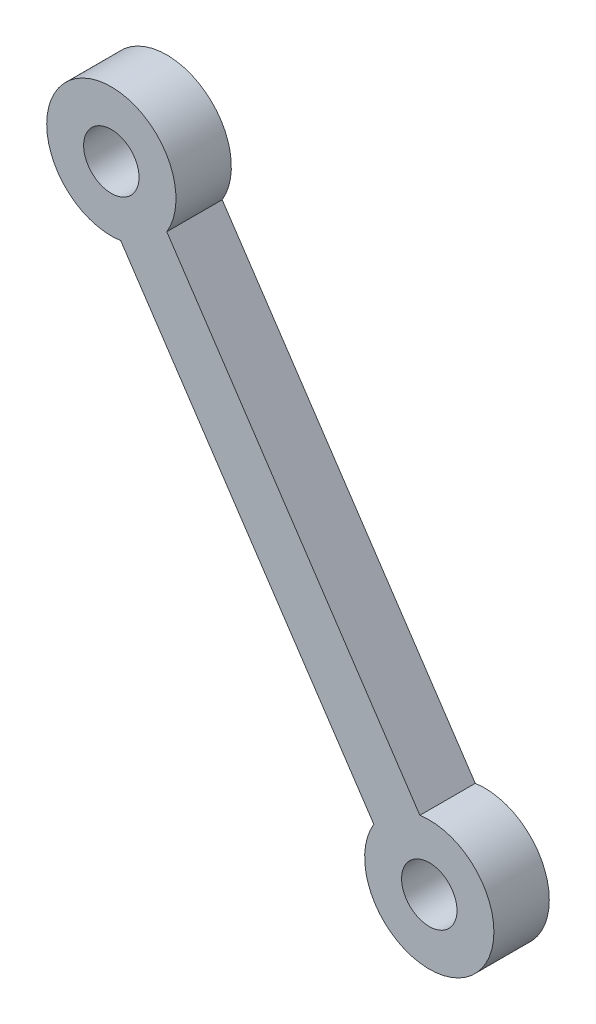
ISO-10303-21;
HEADER;
FILE_DESCRIPTION(('STEP AP214'),'2;1');
FILE_NAME('part.step','',(''),(''),'','','');
FILE_SCHEMA(('AUTOMOTIVE_DESIGN { 1 0 10303 214 1 1 1 1 }'));
ENDSEC;
DATA;
#1=APPLICATION_CONTEXT('core data for automotive mechanical design processes');
#2=APPLICATION_PROTOCOL_DEFINITION('international standard','automotive_design',2000,#1);
#3=PRODUCT_CONTEXT('',#1,'mechanical');
#4=PRODUCT('Part','Part','',(#3));
#5=PRODUCT_RELATED_PRODUCT_CATEGORY('part','',(#4));
#6=PRODUCT_DEFINITION_FORMATION('','',#4);
#7=PRODUCT_DEFINITION_CONTEXT('part definition',#1,'design');
#8=PRODUCT_DEFINITION('design','',#6,#7);
#9=PRODUCT_DEFINITION_SHAPE('','',#8);
#10=(LENGTH_UNIT() NAMED_UNIT(*) SI_UNIT(.MILLI.,.METRE.));
#11=(NAMED_UNIT(*) PLANE_ANGLE_UNIT() SI_UNIT($,.RADIAN.));
#12=(NAMED_UNIT(*) SI_UNIT($,.STERADIAN.) SOLID_ANGLE_UNIT());
#13=UNCERTAINTY_MEASURE_WITH_UNIT(LENGTH_MEASURE(1.E-05),#10,'distance_accuracy_value','');
#14=(GEOMETRIC_REPRESENTATION_CONTEXT(3) GLOBAL_UNCERTAINTY_ASSIGNED_CONTEXT((#13)) GLOBAL_UNIT_ASSIGNED_CONTEXT((#10,
#11,#12)) REPRESENTATION_CONTEXT('',''));
#15=CARTESIAN_POINT('',(0.,0.,0.));
#16=DIRECTION('',(0.,0.,1.));
#17=DIRECTION('',(1.,0.,0.));
#18=AXIS2_PLACEMENT_3D('',#15,#16,#17);
#19=CARTESIAN_POINT('',(-5.23982460190884,57.9999999999995,6.));
#20=DIRECTION('',(0.,0.,-1.));
#21=DIRECTION('',(-0.555467218879167,0.831538434920866,0.));
#22=AXIS2_PLACEMENT_3D('',#19,#20,#21);
#23=CYLINDRICAL_SURFACE('',#22,1.5);
#24=CARTESIAN_POINT('',(-5.23982460190884,57.9999999999995,3.));
#25=DIRECTION('',(0.,0.,1.));
#26=DIRECTION('',(-0.555467218879167,0.831538434920866,0.));
#27=AXIS2_PLACEMENT_3D('',#24,#25,#26);
#28=CIRCLE('',#27,1.5);
#29=CARTESIAN_POINT('',(-4.40662377359009,56.7526923476182,3.));
#30=VERTEX_POINT('',#29);
#31=EDGE_CURVE('E56',#30,#30,#28,.T.);
#32=ORIENTED_EDGE('',*,*,#31,.F.);
#33=DIRECTION('',(0.,0.,1.));
#34=VECTOR('',#33,1.);
#35=CARTESIAN_POINT('',(-4.40662377359009,56.7526923476182,6.));
#36=LINE('',#35,#34);
#37=CARTESIAN_POINT('',(-4.40662377359009,56.7526923476182,6.));
#38=VERTEX_POINT('',#37);
#39=EDGE_CURVE('E11',#30,#38,#36,.T.);
#40=ORIENTED_EDGE('',*,*,#39,.T.);
#41=CARTESIAN_POINT('',(-5.23982460190884,57.9999999999995,6.));
#42=DIRECTION('',(0.,0.,1.));
#43=DIRECTION('',(-0.555467218879167,0.831538434920866,0.));
#44=AXIS2_PLACEMENT_3D('',#41,#42,#43);
#45=CIRCLE('',#44,1.5);
#46=EDGE_CURVE('E48',#38,#38,#45,.T.);
#47=ORIENTED_EDGE('',*,*,#46,.T.);
#48=ORIENTED_EDGE('',*,*,#39,.F.);
#49=EDGE_LOOP('',(#32,#40,#47,#48));
#50=FACE_BOUND('',#49,.T.);
#51=ADVANCED_FACE('F38',(#50),#23,.F.);
#52=CARTESIAN_POINT('',(-22.459308387163,83.7776914825463,6.));
#53=DIRECTION('',(0.,0.,-1.));
#54=DIRECTION('',(-0.555467218879167,0.831538434920866,0.));
#55=AXIS2_PLACEMENT_3D('',#52,#53,#54);
#56=CYLINDRICAL_SURFACE('',#55,1.5);
#57=CARTESIAN_POINT('',(-22.459308387163,83.7776914825463,3.));
#58=DIRECTION('',(0.,0.,1.));
#59=DIRECTION('',(-0.555467218879167,0.831538434920866,0.));
#60=AXIS2_PLACEMENT_3D('',#57,#58,#59);
#61=CIRCLE('',#60,1.5);
#62=CARTESIAN_POINT('',(-21.6261075588443,82.530383830165,3.));
#63=VERTEX_POINT('',#62);
#64=EDGE_CURVE('E129',#63,#63,#61,.T.);
#65=ORIENTED_EDGE('',*,*,#64,.F.);
#66=DIRECTION('',(0.,0.,1.));
#67=VECTOR('',#66,1.);
#68=CARTESIAN_POINT('',(-21.6261075588443,82.530383830165,6.));
#69=LINE('',#68,#67);
#70=CARTESIAN_POINT('',(-21.6261075588443,82.530383830165,6.));
#71=VERTEX_POINT('',#70);
#72=EDGE_CURVE('E133',#63,#71,#69,.T.);
#73=ORIENTED_EDGE('',*,*,#72,.T.);
#74=CARTESIAN_POINT('',(-22.459308387163,83.7776914825463,6.));
#75=DIRECTION('',(0.,0.,1.));
#76=DIRECTION('',(-0.555467218879167,0.831538434920866,0.));
#77=AXIS2_PLACEMENT_3D('',#74,#75,#76);
#78=CIRCLE('',#77,1.5);
#79=EDGE_CURVE('E106',#71,#71,#78,.T.);
#80=ORIENTED_EDGE('',*,*,#79,.T.);
#81=ORIENTED_EDGE('',*,*,#72,.F.);
#82=EDGE_LOOP('',(#65,#73,#80,#81));
#83=FACE_BOUND('',#82,.T.);
#84=ADVANCED_FACE('F149',(#83),#56,.F.);
#85=CARTESIAN_POINT('',(-19.4554591575642,81.9813368945434,6.));
#86=DIRECTION('',(0.831538434920866,0.555467218879167,0.));
#87=DIRECTION('',(-0.555467218879167,0.831538434920866,0.));
#88=AXIS2_PLACEMENT_3D('',#85,#86,#87);
#89=PLANE('',#88);
#90=DIRECTION('',(-0.555467218879167,0.831538434920866,0.));
#91=VECTOR('',#90,1.);
#92=CARTESIAN_POINT('',(-5.74905852674499,61.4627562446399,6.));
#93=LINE('',#92,#91);
#94=CARTESIAN_POINT('',(-5.74905852674499,61.4627562446399,6.));
#95=VERTEX_POINT('',#94);
#96=CARTESIAN_POINT('',(-19.4554591575642,81.9813368945434,6.));
#97=VERTEX_POINT('',#96);
#98=EDGE_CURVE('E88',#95,#97,#93,.T.);
#99=ORIENTED_EDGE('',*,*,#98,.F.);
#100=DIRECTION('',(0.,0.,-1.));
#101=VECTOR('',#100,1.);
#102=CARTESIAN_POINT('',(-5.74905852674499,61.4627562446399,6.));
#103=LINE('',#102,#101);
#104=CARTESIAN_POINT('',(-5.74905852674499,61.4627562446399,3.));
#105=VERTEX_POINT('',#104);
#106=EDGE_CURVE('E91',#95,#105,#103,.T.);
#107=ORIENTED_EDGE('',*,*,#106,.T.);
#108=DIRECTION('',(0.555467218879167,-0.831538434920866,0.));
#109=VECTOR('',#108,1.);
#110=CARTESIAN_POINT('',(-5.74905852674499,61.4627562446399,3.));
#111=LINE('',#110,#109);
#112=CARTESIAN_POINT('',(-19.4554591575642,81.9813368945434,3.));
#113=VERTEX_POINT('',#112);
#114=EDGE_CURVE('E123',#113,#105,#111,.T.);
#115=ORIENTED_EDGE('',*,*,#114,.F.);
#116=DIRECTION('',(0.,0.,-1.));
#117=VECTOR('',#116,1.);
#118=CARTESIAN_POINT('',(-19.4554591575642,81.9813368945434,6.));
#119=LINE('',#118,#117);
#120=EDGE_CURVE('E42',#97,#113,#119,.T.);
#121=ORIENTED_EDGE('',*,*,#120,.F.);
#122=EDGE_LOOP('',(#99,#107,#115,#121));
#123=FACE_BOUND('',#122,.T.);
#124=ADVANCED_FACE('F90',(#123),#89,.T.);
#125=CARTESIAN_POINT('',(-22.459308387163,83.7776914825463,6.));
#126=DIRECTION('',(0.,0.,-1.));
#127=DIRECTION('',(-0.555467218879167,0.831538434920866,0.));
#128=AXIS2_PLACEMENT_3D('',#125,#126,#127);
#129=CYLINDRICAL_SURFACE('',#128,3.5);
#130=CARTESIAN_POINT('',(-22.459308387163,83.7776914825463,6.));
#131=DIRECTION('',(0.,0.,-1.));
#132=DIRECTION('',(-0.555467218879167,0.831538434920866,0.));
#133=AXIS2_PLACEMENT_3D('',#130,#131,#132);
#134=CIRCLE('',#133,3.5);
#135=CARTESIAN_POINT('',(-21.9500744623268,80.3149352379059,6.));
#136=VERTEX_POINT('',#135);
#137=EDGE_CURVE('E107',#136,#97,#134,.T.);
#138=ORIENTED_EDGE('',*,*,#137,.T.);
#139=ORIENTED_EDGE('',*,*,#120,.T.);
#140=CARTESIAN_POINT('',(-22.459308387163,83.7776914825463,3.));
#141=DIRECTION('',(0.,0.,-1.));
#142=DIRECTION('',(-0.555467218879167,0.831538434920866,0.));
#143=AXIS2_PLACEMENT_3D('',#140,#141,#142);
#144=CIRCLE('',#143,3.5);
#145=CARTESIAN_POINT('',(-21.9500744623268,80.3149352379059,3.));
#146=VERTEX_POINT('',#145);
#147=EDGE_CURVE('E120',#146,#113,#144,.T.);
#148=ORIENTED_EDGE('',*,*,#147,.F.);
#149=DIRECTION('',(0.,0.,-1.));
#150=VECTOR('',#149,1.);
#151=CARTESIAN_POINT('',(-21.9500744623268,80.3149352379059,6.));
#152=LINE('',#151,#150);
#153=EDGE_CURVE('E114',#136,#146,#152,.T.);
#154=ORIENTED_EDGE('',*,*,#153,.F.);
#155=EDGE_LOOP('',(#138,#139,#148,#154));
#156=FACE_BOUND('',#155,.T.);
#157=ADVANCED_FACE('F161',(#156),#129,.T.);
#158=CARTESIAN_POINT('',(-8.24367383150758,59.7963545880024,6.));
#159=DIRECTION('',(-0.831538434920866,-0.555467218879167,0.));
#160=DIRECTION('',(0.,0.,1.));
#161=AXIS2_PLACEMENT_3D('',#158,#159,#160);
#162=PLANE('',#161);
#163=DIRECTION('',(-0.555467218879167,0.831538434920866,0.));
#164=VECTOR('',#163,1.);
#165=CARTESIAN_POINT('',(-8.24367383150758,59.7963545880024,6.));
#166=LINE('',#165,#164);
#167=CARTESIAN_POINT('',(-8.24367383150758,59.7963545880024,6.));
#168=VERTEX_POINT('',#167);
#169=EDGE_CURVE('E113',#168,#136,#166,.T.);
#170=ORIENTED_EDGE('',*,*,#169,.T.);
#171=ORIENTED_EDGE('',*,*,#153,.T.);
#172=DIRECTION('',(-0.555467218879167,0.831538434920866,0.));
#173=VECTOR('',#172,1.);
#174=CARTESIAN_POINT('',(-8.24367383150758,59.7963545880024,3.));
#175=LINE('',#174,#173);
#176=CARTESIAN_POINT('',(-8.24367383150758,59.7963545880024,3.));
#177=VERTEX_POINT('',#176);
#178=EDGE_CURVE('E122',#177,#146,#175,.T.);
#179=ORIENTED_EDGE('',*,*,#178,.F.);
#180=DIRECTION('',(0.,0.,-1.));
#181=VECTOR('',#180,1.);
#182=CARTESIAN_POINT('',(-8.24367383150758,59.7963545880024,6.));
#183=LINE('',#182,#181);
#184=EDGE_CURVE('E115',#168,#177,#183,.T.);
#185=ORIENTED_EDGE('',*,*,#184,.F.);
#186=EDGE_LOOP('',(#170,#171,#179,#185));
#187=FACE_BOUND('',#186,.T.);
#188=ADVANCED_FACE('F159',(#187),#162,.T.);
#189=CARTESIAN_POINT('',(-5.23982460190884,57.9999999999995,6.));
#190=DIRECTION('',(0.,0.,-1.));
#191=DIRECTION('',(0.555467218879167,-0.831538434920866,0.));
#192=AXIS2_PLACEMENT_3D('',#189,#190,#191);
#193=CYLINDRICAL_SURFACE('',#192,3.5);
#194=CARTESIAN_POINT('',(-5.23982460190884,57.9999999999995,6.));
#195=DIRECTION('',(0.,0.,-1.));
#196=DIRECTION('',(-0.555467218879167,0.831538434920866,0.));
#197=AXIS2_PLACEMENT_3D('',#194,#195,#196);
#198=CIRCLE('',#197,3.5);
#199=EDGE_CURVE('E103',#95,#168,#198,.T.);
#200=ORIENTED_EDGE('',*,*,#199,.T.);
#201=ORIENTED_EDGE('',*,*,#184,.T.);
#202=CARTESIAN_POINT('',(-5.23982460190884,57.9999999999995,3.));
#203=DIRECTION('',(0.,0.,-1.));
#204=DIRECTION('',(-0.555467218879167,0.831538434920866,0.));
#205=AXIS2_PLACEMENT_3D('',#202,#203,#204);
#206=CIRCLE('',#205,3.5);
#207=EDGE_CURVE('E105',#105,#177,#206,.T.);
#208=ORIENTED_EDGE('',*,*,#207,.F.);
#209=ORIENTED_EDGE('',*,*,#106,.F.);
#210=EDGE_LOOP('',(#200,#201,#208,#209));
#211=FACE_BOUND('',#210,.T.);
#212=ADVANCED_FACE('F101',(#211),#193,.T.);
#213=CARTESIAN_POINT('',(-13.8495664945359,70.8888457412729,3.));
#214=DIRECTION('',(0.,0.,-1.));
#215=DIRECTION('',(-0.555467218879167,0.831538434920866,0.));
#216=AXIS2_PLACEMENT_3D('',#213,#214,#215);
#217=PLANE('',#216);
#218=ORIENTED_EDGE('',*,*,#207,.T.);
#219=ORIENTED_EDGE('',*,*,#178,.T.);
#220=ORIENTED_EDGE('',*,*,#147,.T.);
#221=ORIENTED_EDGE('',*,*,#114,.T.);
#222=EDGE_LOOP('',(#218,#219,#220,#221));
#223=FACE_BOUND('',#222,.T.);
#224=ORIENTED_EDGE('',*,*,#64,.T.);
#225=EDGE_LOOP('',(#224));
#226=FACE_BOUND('',#225,.T.);
#227=ORIENTED_EDGE('',*,*,#31,.T.);
#228=EDGE_LOOP('',(#227));
#229=FACE_BOUND('',#228,.T.);
#230=ADVANCED_FACE('F40',(#223,#226,#229),#217,.T.);
#231=CARTESIAN_POINT('',(-13.8495664945359,70.8888457412729,6.));
#232=DIRECTION('',(0.,0.,-1.));
#233=DIRECTION('',(-0.555467218879167,0.831538434920866,0.));
#234=AXIS2_PLACEMENT_3D('',#231,#232,#233);
#235=PLANE('',#234);
#236=ORIENTED_EDGE('',*,*,#199,.F.);
#237=ORIENTED_EDGE('',*,*,#98,.T.);
#238=ORIENTED_EDGE('',*,*,#137,.F.);
#239=ORIENTED_EDGE('',*,*,#169,.F.);
#240=EDGE_LOOP('',(#236,#237,#238,#239));
#241=FACE_BOUND('',#240,.T.);
#242=ORIENTED_EDGE('',*,*,#79,.F.);
#243=EDGE_LOOP('',(#242));
#244=FACE_BOUND('',#243,.T.);
#245=ORIENTED_EDGE('',*,*,#46,.F.);
#246=EDGE_LOOP('',(#245));
#247=FACE_BOUND('',#246,.T.);
#248=ADVANCED_FACE('F110',(#241,#244,#247),#235,.F.);
#249=CLOSED_SHELL('',(#51,#84,#124,#157,#188,#212,#230,#248));
#250=MANIFOLD_SOLID_BREP('B2',#249);
#251=ADVANCED_BREP_SHAPE_REPRESENTATION('',(#18,#250),#14);
#252=SHAPE_DEFINITION_REPRESENTATION(#9,#251);
ENDSEC;
END-ISO-10303-21;
